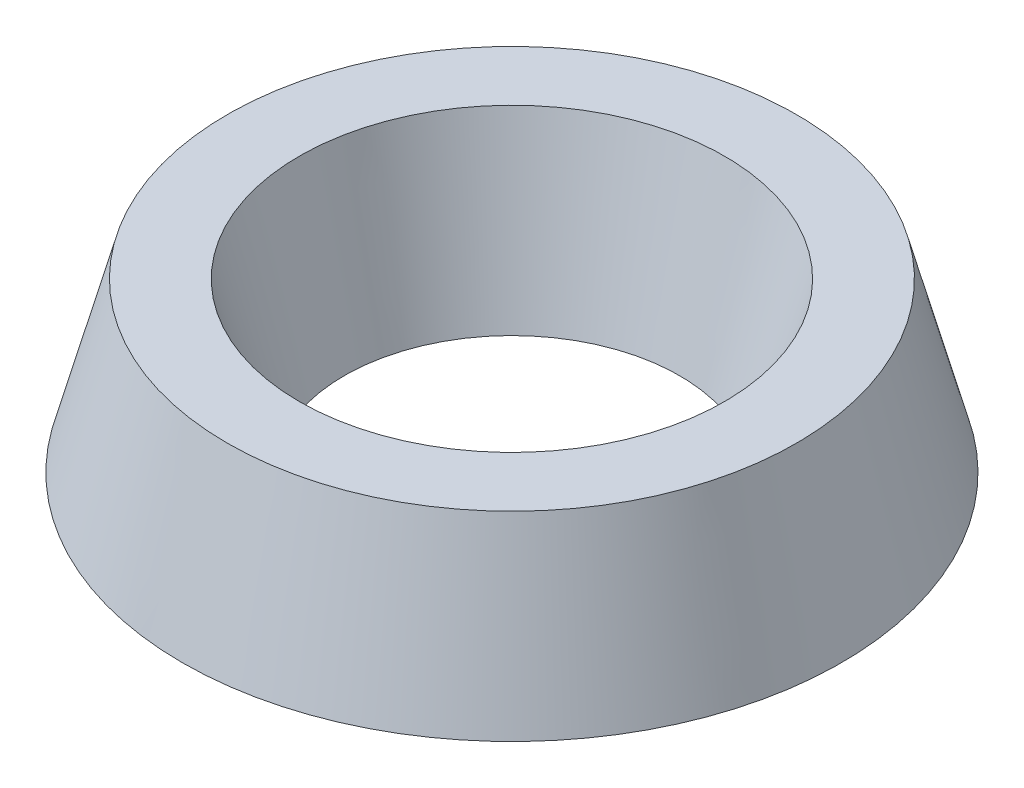
ISO-10303-21;
HEADER;
FILE_DESCRIPTION(('STEP AP214'),'2;1');
FILE_NAME('part.step','',(''),(''),'','','');
FILE_SCHEMA(('AUTOMOTIVE_DESIGN { 1 0 10303 214 1 1 1 1 }'));
ENDSEC;
DATA;
#1=APPLICATION_CONTEXT('core data for automotive mechanical design processes');
#2=APPLICATION_PROTOCOL_DEFINITION('international standard','automotive_design',2000,#1);
#3=PRODUCT_CONTEXT('',#1,'mechanical');
#4=PRODUCT('Part','Part','',(#3));
#5=PRODUCT_RELATED_PRODUCT_CATEGORY('part','',(#4));
#6=PRODUCT_DEFINITION_FORMATION('','',#4);
#7=PRODUCT_DEFINITION_CONTEXT('part definition',#1,'design');
#8=PRODUCT_DEFINITION('design','',#6,#7);
#9=PRODUCT_DEFINITION_SHAPE('','',#8);
#10=(LENGTH_UNIT() NAMED_UNIT(*) SI_UNIT(.MILLI.,.METRE.));
#11=(NAMED_UNIT(*) PLANE_ANGLE_UNIT() SI_UNIT($,.RADIAN.));
#12=(NAMED_UNIT(*) SI_UNIT($,.STERADIAN.) SOLID_ANGLE_UNIT());
#13=UNCERTAINTY_MEASURE_WITH_UNIT(LENGTH_MEASURE(1.E-05),#10,'distance_accuracy_value','');
#14=(GEOMETRIC_REPRESENTATION_CONTEXT(3) GLOBAL_UNCERTAINTY_ASSIGNED_CONTEXT((#13)) GLOBAL_UNIT_ASSIGNED_CONTEXT((#10,
#11,#12)) REPRESENTATION_CONTEXT('',''));
#15=CARTESIAN_POINT('',(0.,0.,0.));
#16=DIRECTION('',(0.,0.,1.));
#17=DIRECTION('',(1.,0.,0.));
#18=AXIS2_PLACEMENT_3D('',#15,#16,#17);
#19=CARTESIAN_POINT('',(0.,3.,0.));
#20=DIRECTION('',(0.,1.,0.));
#21=DIRECTION('',(0.,0.,1.));
#22=AXIS2_PLACEMENT_3D('',#19,#20,#21);
#23=PLANE('',#22);
#24=CARTESIAN_POINT('',(0.,3.,0.));
#25=DIRECTION('',(0.,1.,0.));
#26=DIRECTION('',(0.,0.,1.));
#27=AXIS2_PLACEMENT_3D('',#24,#25,#26);
#28=CIRCLE('',#27,5.09222163096639);
#29=CARTESIAN_POINT('',(0.,3.,5.09222163096639));
#30=VERTEX_POINT('',#29);
#31=EDGE_CURVE('E10',#30,#30,#28,.T.);
#32=ORIENTED_EDGE('',*,*,#31,.T.);
#33=EDGE_LOOP('',(#32));
#34=FACE_BOUND('',#33,.T.);
#35=CARTESIAN_POINT('',(0.,3.,0.));
#36=DIRECTION('',(0.,1.,0.));
#37=DIRECTION('',(0.,0.,1.));
#38=AXIS2_PLACEMENT_3D('',#35,#36,#37);
#39=CIRCLE('',#38,3.80384757729337);
#40=CARTESIAN_POINT('',(0.,3.,3.80384757729337));
#41=VERTEX_POINT('',#40);
#42=EDGE_CURVE('E35',#41,#41,#39,.T.);
#43=ORIENTED_EDGE('',*,*,#42,.F.);
#44=EDGE_LOOP('',(#43));
#45=FACE_BOUND('',#44,.T.);
#46=ADVANCED_FACE('F31',(#34,#45),#23,.T.);
#47=CARTESIAN_POINT('',(0.,0.,0.));
#48=DIRECTION('',(0.,1.,0.));
#49=DIRECTION('',(0.,0.,1.));
#50=AXIS2_PLACEMENT_3D('',#47,#48,#49);
#51=PLANE('',#50);
#52=CARTESIAN_POINT('',(0.,0.,0.));
#53=DIRECTION('',(0.,1.,0.));
#54=DIRECTION('',(0.,0.,1.));
#55=AXIS2_PLACEMENT_3D('',#52,#53,#54);
#56=CIRCLE('',#55,5.89606920825976);
#57=CARTESIAN_POINT('',(0.,0.,5.89606920825976));
#58=VERTEX_POINT('',#57);
#59=EDGE_CURVE('E39',#58,#58,#56,.T.);
#60=ORIENTED_EDGE('',*,*,#59,.F.);
#61=EDGE_LOOP('',(#60));
#62=FACE_BOUND('',#61,.T.);
#63=CARTESIAN_POINT('',(0.,0.,0.));
#64=DIRECTION('',(0.,1.,0.));
#65=DIRECTION('',(0.,0.,1.));
#66=AXIS2_PLACEMENT_3D('',#63,#64,#65);
#67=CIRCLE('',#66,3.);
#68=CARTESIAN_POINT('',(0.,0.,3.));
#69=VERTEX_POINT('',#68);
#70=EDGE_CURVE('E45',#69,#69,#67,.T.);
#71=ORIENTED_EDGE('',*,*,#70,.T.);
#72=EDGE_LOOP('',(#71));
#73=FACE_BOUND('',#72,.T.);
#74=ADVANCED_FACE('F55',(#62,#73),#51,.F.);
#75=CARTESIAN_POINT('',(0.,0.,0.));
#76=DIRECTION('',(0.,-1.,0.));
#77=DIRECTION('',(0.,0.,1.));
#78=AXIS2_PLACEMENT_3D('',#75,#76,#77);
#79=CONICAL_SURFACE('',#78,5.89606920825976,0.26179938779915);
#80=ORIENTED_EDGE('',*,*,#31,.F.);
#81=EDGE_LOOP('',(#80));
#82=FACE_BOUND('',#81,.T.);
#83=ORIENTED_EDGE('',*,*,#59,.T.);
#84=EDGE_LOOP('',(#83));
#85=FACE_BOUND('',#84,.T.);
#86=ADVANCED_FACE('F60',(#82,#85),#79,.T.);
#87=CARTESIAN_POINT('',(0.,0.,0.));
#88=DIRECTION('',(0.,1.,0.));
#89=DIRECTION('',(0.,0.,1.));
#90=AXIS2_PLACEMENT_3D('',#87,#88,#89);
#91=CONICAL_SURFACE('',#90,3.,0.26179938779915);
#92=ORIENTED_EDGE('',*,*,#42,.T.);
#93=EDGE_LOOP('',(#92));
#94=FACE_BOUND('',#93,.T.);
#95=ORIENTED_EDGE('',*,*,#70,.F.);
#96=EDGE_LOOP('',(#95));
#97=FACE_BOUND('',#96,.T.);
#98=ADVANCED_FACE('F33',(#94,#97),#91,.F.);
#99=CLOSED_SHELL('',(#46,#74,#86,#98));
#100=MANIFOLD_SOLID_BREP('B2',#99);
#101=ADVANCED_BREP_SHAPE_REPRESENTATION('',(#18,#100),#14);
#102=SHAPE_DEFINITION_REPRESENTATION(#9,#101);
ENDSEC;
END-ISO-10303-21;
